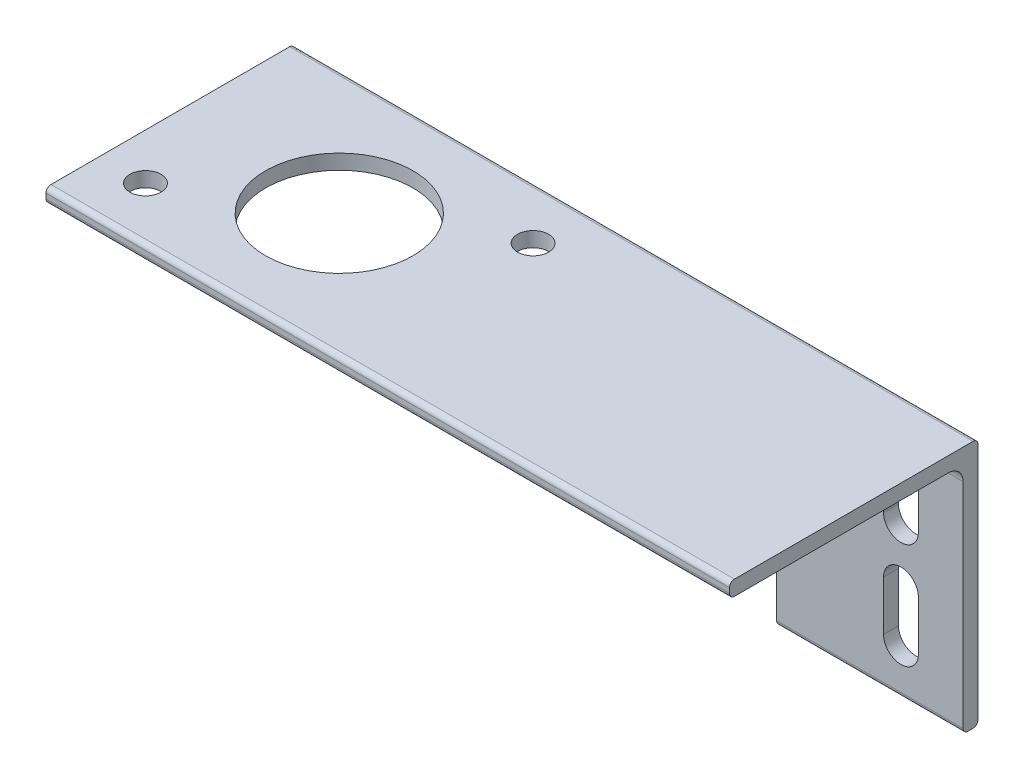
ISO-10303-21;
HEADER;
FILE_DESCRIPTION(('STEP AP214'),'2;1');
FILE_NAME('part.step','',(''),(''),'','','');
FILE_SCHEMA(('AUTOMOTIVE_DESIGN { 1 0 10303 214 1 1 1 1 }'));
ENDSEC;
DATA;
#1=APPLICATION_CONTEXT('core data for automotive mechanical design processes');
#2=APPLICATION_PROTOCOL_DEFINITION('international standard','automotive_design',2000,#1);
#3=PRODUCT_CONTEXT('',#1,'mechanical');
#4=PRODUCT('Part','Part','',(#3));
#5=PRODUCT_RELATED_PRODUCT_CATEGORY('part','',(#4));
#6=PRODUCT_DEFINITION_FORMATION('','',#4);
#7=PRODUCT_DEFINITION_CONTEXT('part definition',#1,'design');
#8=PRODUCT_DEFINITION('design','',#6,#7);
#9=PRODUCT_DEFINITION_SHAPE('','',#8);
#10=(LENGTH_UNIT() NAMED_UNIT(*) SI_UNIT(.MILLI.,.METRE.));
#11=(NAMED_UNIT(*) PLANE_ANGLE_UNIT() SI_UNIT($,.RADIAN.));
#12=(NAMED_UNIT(*) SI_UNIT($,.STERADIAN.) SOLID_ANGLE_UNIT());
#13=UNCERTAINTY_MEASURE_WITH_UNIT(LENGTH_MEASURE(1.E-05),#10,'distance_accuracy_value','');
#14=(GEOMETRIC_REPRESENTATION_CONTEXT(3) GLOBAL_UNCERTAINTY_ASSIGNED_CONTEXT((#13)) GLOBAL_UNIT_ASSIGNED_CONTEXT((#10,
#11,#12)) REPRESENTATION_CONTEXT('',''));
#15=CARTESIAN_POINT('',(0.,0.,0.));
#16=DIRECTION('',(0.,0.,1.));
#17=DIRECTION('',(1.,0.,0.));
#18=AXIS2_PLACEMENT_3D('',#15,#16,#17);
#19=CARTESIAN_POINT('',(69.85,11.176,-9.65199999999999));
#20=DIRECTION('',(0.,1.,0.));
#21=DIRECTION('',(0.,0.,1.));
#22=AXIS2_PLACEMENT_3D('',#19,#20,#21);
#23=PLANE('',#22);
#24=CARTESIAN_POINT('',(29.8293683548743,11.176,-7.25000000000002));
#25=DIRECTION('',(0.,1.,0.));
#26=DIRECTION('',(0.,0.,1.));
#27=AXIS2_PLACEMENT_3D('',#24,#25,#26);
#28=CIRCLE('',#27,1.5875);
#29=CARTESIAN_POINT('',(29.8293683548743,11.176,-5.66250000000003));
#30=VERTEX_POINT('',#29);
#31=EDGE_CURVE('E399',#30,#30,#28,.T.);
#32=ORIENTED_EDGE('',*,*,#31,.T.);
#33=EDGE_LOOP('',(#32));
#34=FACE_BOUND('',#33,.T.);
#35=CARTESIAN_POINT('',(4.71463164512565,11.176,7.25000000000002));
#36=DIRECTION('',(0.,1.,0.));
#37=DIRECTION('',(0.,0.,1.));
#38=AXIS2_PLACEMENT_3D('',#35,#36,#37);
#39=CIRCLE('',#38,1.5875);
#40=CARTESIAN_POINT('',(4.71463164512565,11.176,8.83750000000002));
#41=VERTEX_POINT('',#40);
#42=EDGE_CURVE('E395',#41,#41,#39,.T.);
#43=ORIENTED_EDGE('',*,*,#42,.T.);
#44=EDGE_LOOP('',(#43));
#45=FACE_BOUND('',#44,.T.);
#46=CARTESIAN_POINT('',(17.272,11.176,0.));
#47=DIRECTION('',(0.,1.,0.));
#48=DIRECTION('',(0.,0.,1.));
#49=AXIS2_PLACEMENT_3D('',#46,#47,#48);
#50=CIRCLE('',#49,7.53109999999999);
#51=CARTESIAN_POINT('',(17.272,11.176,7.5311));
#52=VERTEX_POINT('',#51);
#53=EDGE_CURVE('E391',#52,#52,#50,.T.);
#54=ORIENTED_EDGE('',*,*,#53,.T.);
#55=EDGE_LOOP('',(#54));
#56=FACE_BOUND('',#55,.T.);
#57=DIRECTION('',(0.,0.,-1.));
#58=VECTOR('',#57,1.);
#59=CARTESIAN_POINT('',(0.,11.176,-9.65199999999999));
#60=LINE('',#59,#58);
#61=CARTESIAN_POINT('',(0.,11.176,12.192));
#62=VERTEX_POINT('',#61);
#63=CARTESIAN_POINT('',(0.,11.176,-9.65199999999999));
#64=VERTEX_POINT('',#63);
#65=EDGE_CURVE('E403',#62,#64,#60,.T.);
#66=ORIENTED_EDGE('',*,*,#65,.T.);
#67=DIRECTION('',(-1.,0.,0.));
#68=VECTOR('',#67,1.);
#69=CARTESIAN_POINT('',(69.85,11.176,-9.65199999999999));
#70=LINE('',#69,#68);
#71=CARTESIAN_POINT('',(69.85,11.176,-9.65199999999999));
#72=VERTEX_POINT('',#71);
#73=EDGE_CURVE('E48',#72,#64,#70,.T.);
#74=ORIENTED_EDGE('',*,*,#73,.F.);
#75=DIRECTION('',(0.,0.,-1.));
#76=VECTOR('',#75,1.);
#77=CARTESIAN_POINT('',(69.85,11.176,11.176));
#78=LINE('',#77,#76);
#79=CARTESIAN_POINT('',(69.85,11.176,12.192));
#80=VERTEX_POINT('',#79);
#81=EDGE_CURVE('E404',#80,#72,#78,.T.);
#82=ORIENTED_EDGE('',*,*,#81,.F.);
#83=DIRECTION('',(-1.,0.,0.));
#84=VECTOR('',#83,1.);
#85=CARTESIAN_POINT('',(69.85,11.176,12.192));
#86=LINE('',#85,#84);
#87=EDGE_CURVE('E441',#80,#62,#86,.T.);
#88=ORIENTED_EDGE('',*,*,#87,.T.);
#89=EDGE_LOOP('',(#66,#74,#82,#88));
#90=FACE_BOUND('',#89,.T.);
#91=ADVANCED_FACE('F40',(#34,#45,#56,#90),#23,.F.);
#92=CARTESIAN_POINT('',(69.85,9.652,-9.652));
#93=DIRECTION('',(-1.,0.,0.));
#94=DIRECTION('',(0.,0.,1.));
#95=AXIS2_PLACEMENT_3D('',#92,#93,#94);
#96=CYLINDRICAL_SURFACE('',#95,1.524);
#97=DIRECTION('',(-1.,0.,0.));
#98=VECTOR('',#97,1.);
#99=CARTESIAN_POINT('',(69.85,9.65199999999999,-11.176));
#100=LINE('',#99,#98);
#101=CARTESIAN_POINT('',(63.0290713960694,9.65199999999999,-11.176));
#102=VERTEX_POINT('',#101);
#103=CARTESIAN_POINT('',(41.3856159336174,9.65199999999999,-11.176));
#104=VERTEX_POINT('',#103);
#105=EDGE_CURVE('E505',#102,#104,#100,.T.);
#106=ORIENTED_EDGE('',*,*,#105,.F.);
#107=CARTESIAN_POINT('',(63.0290713960694,9.65199999999999,-11.176));
#108=CARTESIAN_POINT('',(63.0777992399456,9.66538999720252,-11.1759819622574));
#109=CARTESIAN_POINT('',(63.1270995867601,9.67669179860836,-11.1758228229992));
#110=CARTESIAN_POINT('',(63.2264955945751,9.69506338411322,-11.1754240084948));
#111=CARTESIAN_POINT('',(63.2765914571137,9.70213207764346,-11.1751843125198));
#112=CARTESIAN_POINT('',(63.3760948841915,9.7118664264163,-11.1748302133358));
#113=CARTESIAN_POINT('',(63.425493293004,9.71462566714394,-11.1747131657762));
#114=CARTESIAN_POINT('',(63.5243279571172,9.71602027880757,-11.1746545963654));
#115=CARTESIAN_POINT('',(63.573764191208,9.7146571997042,-11.1747130085427));
#116=CARTESIAN_POINT('',(63.681436033279,9.70718513616487,-11.1750086003796));
#117=CARTESIAN_POINT('',(63.73961573386,9.70024847605331,-11.1752767170522));
#118=CARTESIAN_POINT('',(63.8557798569389,9.68055257183415,-11.1757554236398));
#119=CARTESIAN_POINT('',(63.9137513339969,9.66771693073628,-11.1759651989151));
#120=CARTESIAN_POINT('',(63.9709286039306,9.65199999999999,-11.176));
#121=B_SPLINE_CURVE_WITH_KNOTS('',3,(#107,#108,#109,#110,#111,#112,#113,#114,#115,#116,#117,
#118,#119,#120),.UNSPECIFIED.,.F.,.F.,(4,2,2,2,2,2,4),(0.,0.151554911187072,0.30314885044388,
0.451402540313249,0.599600494863249,0.775087038517862,0.952913269558954),.UNSPECIFIED.);
#122=CARTESIAN_POINT('',(63.9709286039306,9.65199999999999,-11.176));
#123=VERTEX_POINT('',#122);
#124=EDGE_CURVE('E322',#102,#123,#121,.T.);
#125=ORIENTED_EDGE('',*,*,#124,.T.);
#126=CARTESIAN_POINT('',(69.85,9.65199999999999,-11.176));
#127=VERTEX_POINT('',#126);
#128=EDGE_CURVE('E506',#127,#123,#100,.T.);
#129=ORIENTED_EDGE('',*,*,#128,.F.);
#130=CARTESIAN_POINT('',(69.85,9.652,-9.652));
#131=DIRECTION('',(-1.,0.,0.));
#132=DIRECTION('',(0.,0.,1.));
#133=AXIS2_PLACEMENT_3D('',#130,#131,#132);
#134=CIRCLE('',#133,1.524);
#135=EDGE_CURVE('E407',#72,#127,#134,.T.);
#136=ORIENTED_EDGE('',*,*,#135,.F.);
#137=ORIENTED_EDGE('',*,*,#73,.T.);
#138=CARTESIAN_POINT('',(0.,9.652,-9.652));
#139=DIRECTION('',(-1.,0.,0.));
#140=DIRECTION('',(0.,0.,1.));
#141=AXIS2_PLACEMENT_3D('',#138,#139,#140);
#142=CIRCLE('',#141,1.524);
#143=CARTESIAN_POINT('',(0.,10.0843707287529,-11.1133800166));
#144=VERTEX_POINT('',#143);
#145=EDGE_CURVE('E444',#64,#144,#142,.T.);
#146=ORIENTED_EDGE('',*,*,#145,.T.);
#147=DIRECTION('',(-1.,0.,0.));
#148=VECTOR('',#147,1.);
#149=CARTESIAN_POINT('',(69.85,10.0843707287529,-11.1133800166));
#150=LINE('',#149,#148);
#151=CARTESIAN_POINT('',(38.1,10.0843707287529,-11.1133800166));
#152=VERTEX_POINT('',#151);
#153=EDGE_CURVE('E532',#144,#152,#150,.F.);
#154=ORIENTED_EDGE('',*,*,#153,.T.);
#155=CARTESIAN_POINT('',(38.1,10.0843707287529,-11.1133800166));
#156=CARTESIAN_POINT('',(38.2388114470177,10.0843718247758,-11.113355369512));
#157=CARTESIAN_POINT('',(38.3776212297214,10.0820949547385,-11.1140526116334));
#158=CARTESIAN_POINT('',(38.6550715926149,10.072993673335,-11.1167121813116));
#159=CARTESIAN_POINT('',(38.793712182295,10.0661695300017,-11.118674434304));
#160=CARTESIAN_POINT('',(39.0700837279161,10.0480208976851,-11.1236746800685));
#161=CARTESIAN_POINT('',(39.207816040881,10.036715737824,-11.1267080464769));
#162=CARTESIAN_POINT('',(39.4828224243225,10.0096189602505,-11.1335130543283));
#163=CARTESIAN_POINT('',(39.6200964855515,9.99382725254667,-11.1372847105795));
#164=CARTESIAN_POINT('',(39.8940384819999,9.95777562730188,-11.1451233390409));
#165=CARTESIAN_POINT('',(40.0307064572966,9.937516009833,-11.1491902914063));
#166=CARTESIAN_POINT('',(40.3033124464167,9.89254799265674,-11.1570689687988));
#167=CARTESIAN_POINT('',(40.4392504781809,9.86783970280892,-11.1608807001255));
#168=CARTESIAN_POINT('',(40.7108575643859,9.81387890922683,-11.1676246646815));
#169=CARTESIAN_POINT('',(40.8465229185448,9.78460723149433,-11.1705530264769));
#170=CARTESIAN_POINT('',(41.116856991311,9.7216250449296,-11.1747306011683));
#171=CARTESIAN_POINT('',(41.2515256164727,9.6879141253387,-11.17597965856));
#172=CARTESIAN_POINT('',(41.3856159336174,9.65199999999999,-11.176));
#173=B_SPLINE_CURVE_WITH_KNOTS('',3,(#155,#156,#157,#158,#159,#160,#161,#162,#163,#164,#165,
#166,#167,#168,#169,#170,#171,#172),.UNSPECIFIED.,.F.,.F.,(4,2,2,2,2,2,2,2,4),(0.,
0.416411274834562,0.832798007051295,1.24740784368926,1.66202599716687,2.07661631268794,
2.49119639134268,2.90756784941136,3.32397786102639),.UNSPECIFIED.);
#174=EDGE_CURVE('E369',#152,#104,#173,.T.);
#175=ORIENTED_EDGE('',*,*,#174,.T.);
#176=EDGE_LOOP('',(#106,#125,#129,#136,#137,#146,#154,#175));
#177=FACE_BOUND('',#176,.T.);
#178=ADVANCED_FACE('F333',(#177),#96,.F.);
#179=CARTESIAN_POINT('',(69.85,-11.176,-11.176));
#180=DIRECTION('',(0.,0.,-1.));
#181=DIRECTION('',(-1.,0.,0.));
#182=AXIS2_PLACEMENT_3D('',#179,#180,#181);
#183=PLANE('',#182);
#184=DIRECTION('',(0.,-1.,0.));
#185=VECTOR('',#184,1.);
#186=CARTESIAN_POINT('',(65.278,-11.176,-11.176));
#187=LINE('',#186,#185);
#188=CARTESIAN_POINT('',(65.278,-2.85749999999999,-11.176));
#189=VERTEX_POINT('',#188);
#190=CARTESIAN_POINT('',(65.278,-7.93749999999999,-11.176));
#191=VERTEX_POINT('',#190);
#192=EDGE_CURVE('E579',#189,#191,#187,.T.);
#193=ORIENTED_EDGE('',*,*,#192,.T.);
#194=CARTESIAN_POINT('',(63.5,-7.93749999999999,-11.176));
#195=DIRECTION('',(0.,0.,-1.));
#196=DIRECTION('',(-1.,0.,0.));
#197=AXIS2_PLACEMENT_3D('',#194,#195,#196);
#198=CIRCLE('',#197,1.778);
#199=CARTESIAN_POINT('',(61.722,-7.93749999999999,-11.176));
#200=VERTEX_POINT('',#199);
#201=EDGE_CURVE('E576',#191,#200,#198,.T.);
#202=ORIENTED_EDGE('',*,*,#201,.T.);
#203=DIRECTION('',(0.,1.,0.));
#204=VECTOR('',#203,1.);
#205=CARTESIAN_POINT('',(61.722,-11.176,-11.176));
#206=LINE('',#205,#204);
#207=CARTESIAN_POINT('',(61.722,-2.85749999999999,-11.176));
#208=VERTEX_POINT('',#207);
#209=EDGE_CURVE('E586',#200,#208,#206,.T.);
#210=ORIENTED_EDGE('',*,*,#209,.T.);
#211=CARTESIAN_POINT('',(63.5,-2.85749999999999,-11.176));
#212=DIRECTION('',(0.,0.,-1.));
#213=DIRECTION('',(-1.,0.,0.));
#214=AXIS2_PLACEMENT_3D('',#211,#212,#213);
#215=CIRCLE('',#214,1.778);
#216=EDGE_CURVE('E253',#208,#189,#215,.T.);
#217=ORIENTED_EDGE('',*,*,#216,.T.);
#218=EDGE_LOOP('',(#193,#202,#210,#217));
#219=FACE_BOUND('',#218,.T.);
#220=ORIENTED_EDGE('',*,*,#128,.T.);
#221=CARTESIAN_POINT('',(63.5,7.9375,-11.176));
#222=DIRECTION('',(0.,0.,-1.));
#223=DIRECTION('',(-1.,0.,0.));
#224=AXIS2_PLACEMENT_3D('',#221,#222,#223);
#225=CIRCLE('',#224,1.778);
#226=CARTESIAN_POINT('',(65.278,7.9375,-11.176));
#227=VERTEX_POINT('',#226);
#228=EDGE_CURVE('E318',#123,#227,#225,.T.);
#229=ORIENTED_EDGE('',*,*,#228,.T.);
#230=DIRECTION('',(0.,-1.,0.));
#231=VECTOR('',#230,1.);
#232=CARTESIAN_POINT('',(65.278,-11.176,-11.176));
#233=LINE('',#232,#231);
#234=CARTESIAN_POINT('',(65.278,2.8575,-11.176));
#235=VERTEX_POINT('',#234);
#236=EDGE_CURVE('E331',#227,#235,#233,.T.);
#237=ORIENTED_EDGE('',*,*,#236,.T.);
#238=CARTESIAN_POINT('',(63.5,2.8575,-11.176));
#239=DIRECTION('',(0.,0.,-1.));
#240=DIRECTION('',(-1.,0.,0.));
#241=AXIS2_PLACEMENT_3D('',#238,#239,#240);
#242=CIRCLE('',#241,1.778);
#243=CARTESIAN_POINT('',(61.722,2.8575,-11.176));
#244=VERTEX_POINT('',#243);
#245=EDGE_CURVE('E588',#235,#244,#242,.T.);
#246=ORIENTED_EDGE('',*,*,#245,.T.);
#247=DIRECTION('',(0.,1.,0.));
#248=VECTOR('',#247,1.);
#249=CARTESIAN_POINT('',(61.722,-11.176,-11.176));
#250=LINE('',#249,#248);
#251=CARTESIAN_POINT('',(61.722,7.9375,-11.176));
#252=VERTEX_POINT('',#251);
#253=EDGE_CURVE('E284',#244,#252,#250,.T.);
#254=ORIENTED_EDGE('',*,*,#253,.T.);
#255=EDGE_CURVE('E323',#252,#102,#225,.T.);
#256=ORIENTED_EDGE('',*,*,#255,.T.);
#257=ORIENTED_EDGE('',*,*,#105,.T.);
#258=CARTESIAN_POINT('',(38.1,-2.61562927124714,-11.176));
#259=DIRECTION('',(0.,0.,-1.));
#260=DIRECTION('',(-1.,0.,0.));
#261=AXIS2_PLACEMENT_3D('',#258,#259,#260);
#262=CIRCLE('',#261,12.7);
#263=CARTESIAN_POINT('',(50.8,-2.61562927124714,-11.176));
#264=VERTEX_POINT('',#263);
#265=EDGE_CURVE('E378',#104,#264,#262,.T.);
#266=ORIENTED_EDGE('',*,*,#265,.T.);
#267=DIRECTION('',(0.,-1.,0.));
#268=VECTOR('',#267,1.);
#269=CARTESIAN_POINT('',(50.8,-11.176,-11.176));
#270=LINE('',#269,#268);
#271=CARTESIAN_POINT('',(50.8,-12.192,-11.176));
#272=VERTEX_POINT('',#271);
#273=EDGE_CURVE('E563',#264,#272,#270,.T.);
#274=ORIENTED_EDGE('',*,*,#273,.T.);
#275=DIRECTION('',(-1.,0.,0.));
#276=VECTOR('',#275,1.);
#277=CARTESIAN_POINT('',(69.85,-12.192,-11.176));
#278=LINE('',#277,#276);
#279=CARTESIAN_POINT('',(69.85,-12.192,-11.176));
#280=VERTEX_POINT('',#279);
#281=EDGE_CURVE('E501',#280,#272,#278,.T.);
#282=ORIENTED_EDGE('',*,*,#281,.F.);
#283=DIRECTION('',(0.,-1.,0.));
#284=VECTOR('',#283,1.);
#285=CARTESIAN_POINT('',(69.85,9.65199999999999,-11.176));
#286=LINE('',#285,#284);
#287=EDGE_CURVE('E411',#127,#280,#286,.T.);
#288=ORIENTED_EDGE('',*,*,#287,.F.);
#289=EDGE_LOOP('',(#220,#229,#237,#246,#254,#256,#257,#266,#274,#282,#288));
#290=FACE_BOUND('',#289,.T.);
#291=ADVANCED_FACE('F572',(#219,#290),#183,.F.);
#292=CARTESIAN_POINT('',(69.85,-12.192,-11.684));
#293=DIRECTION('',(-1.,0.,0.));
#294=DIRECTION('',(0.,0.,1.));
#295=AXIS2_PLACEMENT_3D('',#292,#293,#294);
#296=CYLINDRICAL_SURFACE('',#295,0.508);
#297=ORIENTED_EDGE('',*,*,#281,.T.);
#298=CARTESIAN_POINT('',(50.8,-12.192,-11.684));
#299=DIRECTION('',(1.,0.,0.));
#300=DIRECTION('',(0.,0.,-1.));
#301=AXIS2_PLACEMENT_3D('',#298,#299,#300);
#302=CIRCLE('',#301,0.508);
#303=CARTESIAN_POINT('',(50.8,-12.7,-11.684));
#304=VERTEX_POINT('',#303);
#305=EDGE_CURVE('E560',#272,#304,#302,.T.);
#306=ORIENTED_EDGE('',*,*,#305,.T.);
#307=DIRECTION('',(-1.,0.,0.));
#308=VECTOR('',#307,1.);
#309=CARTESIAN_POINT('',(69.85,-12.7,-11.684));
#310=LINE('',#309,#308);
#311=CARTESIAN_POINT('',(69.85,-12.7,-11.684));
#312=VERTEX_POINT('',#311);
#313=EDGE_CURVE('E497',#312,#304,#310,.T.);
#314=ORIENTED_EDGE('',*,*,#313,.F.);
#315=CARTESIAN_POINT('',(69.85,-12.192,-11.684));
#316=DIRECTION('',(1.,0.,0.));
#317=DIRECTION('',(0.,0.,-1.));
#318=AXIS2_PLACEMENT_3D('',#315,#316,#317);
#319=CIRCLE('',#318,0.508);
#320=EDGE_CURVE('E414',#280,#312,#319,.T.);
#321=ORIENTED_EDGE('',*,*,#320,.F.);
#322=EDGE_LOOP('',(#297,#306,#314,#321));
#323=FACE_BOUND('',#322,.T.);
#324=ADVANCED_FACE('F632',(#323),#296,.T.);
#325=CARTESIAN_POINT('',(69.85,-12.7,-12.192));
#326=DIRECTION('',(0.,1.,0.));
#327=DIRECTION('',(0.,0.,1.));
#328=AXIS2_PLACEMENT_3D('',#325,#326,#327);
#329=PLANE('',#328);
#330=ORIENTED_EDGE('',*,*,#313,.T.);
#331=DIRECTION('',(0.,0.,-1.));
#332=VECTOR('',#331,1.);
#333=CARTESIAN_POINT('',(50.8,-12.7,-12.192));
#334=LINE('',#333,#332);
#335=CARTESIAN_POINT('',(50.8,-12.7,-12.192));
#336=VERTEX_POINT('',#335);
#337=EDGE_CURVE('E556',#304,#336,#334,.T.);
#338=ORIENTED_EDGE('',*,*,#337,.T.);
#339=DIRECTION('',(-1.,0.,0.));
#340=VECTOR('',#339,1.);
#341=CARTESIAN_POINT('',(69.85,-12.7,-12.192));
#342=LINE('',#341,#340);
#343=CARTESIAN_POINT('',(69.85,-12.7,-12.192));
#344=VERTEX_POINT('',#343);
#345=EDGE_CURVE('E493',#344,#336,#342,.T.);
#346=ORIENTED_EDGE('',*,*,#345,.F.);
#347=DIRECTION('',(0.,0.,-1.));
#348=VECTOR('',#347,1.);
#349=CARTESIAN_POINT('',(69.85,-12.7,-12.192));
#350=LINE('',#349,#348);
#351=EDGE_CURVE('E417',#312,#344,#350,.T.);
#352=ORIENTED_EDGE('',*,*,#351,.F.);
#353=EDGE_LOOP('',(#330,#338,#346,#352));
#354=FACE_BOUND('',#353,.T.);
#355=ADVANCED_FACE('F630',(#354),#329,.F.);
#356=CARTESIAN_POINT('',(69.85,-12.192,-12.192));
#357=DIRECTION('',(-1.,0.,0.));
#358=DIRECTION('',(0.,0.,1.));
#359=AXIS2_PLACEMENT_3D('',#356,#357,#358);
#360=CYLINDRICAL_SURFACE('',#359,0.508);
#361=ORIENTED_EDGE('',*,*,#345,.T.);
#362=CARTESIAN_POINT('',(50.8,-12.192,-12.192));
#363=DIRECTION('',(1.,0.,0.));
#364=DIRECTION('',(0.,0.,-1.));
#365=AXIS2_PLACEMENT_3D('',#362,#363,#364);
#366=CIRCLE('',#365,0.508);
#367=CARTESIAN_POINT('',(50.8,-12.192,-12.7));
#368=VERTEX_POINT('',#367);
#369=EDGE_CURVE('E552',#336,#368,#366,.T.);
#370=ORIENTED_EDGE('',*,*,#369,.T.);
#371=DIRECTION('',(-1.,0.,0.));
#372=VECTOR('',#371,1.);
#373=CARTESIAN_POINT('',(69.85,-12.192,-12.7));
#374=LINE('',#373,#372);
#375=CARTESIAN_POINT('',(69.85,-12.192,-12.7));
#376=VERTEX_POINT('',#375);
#377=EDGE_CURVE('E489',#376,#368,#374,.T.);
#378=ORIENTED_EDGE('',*,*,#377,.F.);
#379=CARTESIAN_POINT('',(69.85,-12.192,-12.192));
#380=DIRECTION('',(1.,0.,0.));
#381=DIRECTION('',(0.,0.,1.));
#382=AXIS2_PLACEMENT_3D('',#379,#380,#381);
#383=CIRCLE('',#382,0.508);
#384=EDGE_CURVE('E420',#344,#376,#383,.T.);
#385=ORIENTED_EDGE('',*,*,#384,.F.);
#386=EDGE_LOOP('',(#361,#370,#378,#385));
#387=FACE_BOUND('',#386,.T.);
#388=ADVANCED_FACE('F628',(#387),#360,.T.);
#389=CARTESIAN_POINT('',(69.85,12.192,-12.7));
#390=DIRECTION('',(0.,0.,1.));
#391=DIRECTION('',(0.,-1.,0.));
#392=AXIS2_PLACEMENT_3D('',#389,#390,#391);
#393=PLANE('',#392);
#394=DIRECTION('',(0.,1.,0.));
#395=VECTOR('',#394,1.);
#396=CARTESIAN_POINT('',(61.722,-7.93749999999999,-12.7));
#397=LINE('',#396,#395);
#398=CARTESIAN_POINT('',(61.722,-7.93749999999999,-12.7));
#399=VERTEX_POINT('',#398);
#400=CARTESIAN_POINT('',(61.722,-2.85749999999999,-12.7));
#401=VERTEX_POINT('',#400);
#402=EDGE_CURVE('E261',#399,#401,#397,.T.);
#403=ORIENTED_EDGE('',*,*,#402,.F.);
#404=CARTESIAN_POINT('',(63.5,-7.93749999999999,-12.7));
#405=DIRECTION('',(0.,0.,-1.));
#406=DIRECTION('',(0.,1.,0.));
#407=AXIS2_PLACEMENT_3D('',#404,#405,#406);
#408=CIRCLE('',#407,1.778);
#409=CARTESIAN_POINT('',(65.278,-7.93749999999999,-12.7));
#410=VERTEX_POINT('',#409);
#411=EDGE_CURVE('E267',#410,#399,#408,.T.);
#412=ORIENTED_EDGE('',*,*,#411,.F.);
#413=DIRECTION('',(0.,-1.,0.));
#414=VECTOR('',#413,1.);
#415=CARTESIAN_POINT('',(65.278,-7.93749999999999,-12.7));
#416=LINE('',#415,#414);
#417=CARTESIAN_POINT('',(65.278,-2.85749999999999,-12.7));
#418=VERTEX_POINT('',#417);
#419=EDGE_CURVE('E272',#418,#410,#416,.T.);
#420=ORIENTED_EDGE('',*,*,#419,.F.);
#421=CARTESIAN_POINT('',(63.5,-2.85749999999999,-12.7));
#422=DIRECTION('',(0.,0.,-1.));
#423=DIRECTION('',(0.,1.,0.));
#424=AXIS2_PLACEMENT_3D('',#421,#422,#423);
#425=CIRCLE('',#424,1.778);
#426=EDGE_CURVE('E250',#401,#418,#425,.T.);
#427=ORIENTED_EDGE('',*,*,#426,.F.);
#428=EDGE_LOOP('',(#403,#412,#420,#427));
#429=FACE_BOUND('',#428,.T.);
#430=DIRECTION('',(0.,1.,0.));
#431=VECTOR('',#430,1.);
#432=CARTESIAN_POINT('',(61.722,2.8575,-12.7));
#433=LINE('',#432,#431);
#434=CARTESIAN_POINT('',(61.722,2.8575,-12.7));
#435=VERTEX_POINT('',#434);
#436=CARTESIAN_POINT('',(61.722,7.9375,-12.7));
#437=VERTEX_POINT('',#436);
#438=EDGE_CURVE('E292',#435,#437,#433,.T.);
#439=ORIENTED_EDGE('',*,*,#438,.F.);
#440=CARTESIAN_POINT('',(63.5,2.8575,-12.7));
#441=DIRECTION('',(0.,0.,-1.));
#442=DIRECTION('',(0.,1.,0.));
#443=AXIS2_PLACEMENT_3D('',#440,#441,#442);
#444=CIRCLE('',#443,1.778);
#445=CARTESIAN_POINT('',(65.278,2.8575,-12.7));
#446=VERTEX_POINT('',#445);
#447=EDGE_CURVE('E289',#446,#435,#444,.T.);
#448=ORIENTED_EDGE('',*,*,#447,.F.);
#449=DIRECTION('',(0.,-1.,0.));
#450=VECTOR('',#449,1.);
#451=CARTESIAN_POINT('',(65.278,2.8575,-12.7));
#452=LINE('',#451,#450);
#453=CARTESIAN_POINT('',(65.278,7.9375,-12.7));
#454=VERTEX_POINT('',#453);
#455=EDGE_CURVE('E299',#454,#446,#452,.T.);
#456=ORIENTED_EDGE('',*,*,#455,.F.);
#457=CARTESIAN_POINT('',(63.5,7.9375,-12.7));
#458=DIRECTION('',(0.,0.,-1.));
#459=DIRECTION('',(0.,1.,0.));
#460=AXIS2_PLACEMENT_3D('',#457,#458,#459);
#461=CIRCLE('',#460,1.778);
#462=EDGE_CURVE('E295',#437,#454,#461,.T.);
#463=ORIENTED_EDGE('',*,*,#462,.F.);
#464=EDGE_LOOP('',(#439,#448,#456,#463));
#465=FACE_BOUND('',#464,.T.);
#466=CARTESIAN_POINT('',(38.1,-2.61562927124714,-12.7));
#467=DIRECTION('',(0.,0.,-1.));
#468=DIRECTION('',(0.,1.,0.));
#469=AXIS2_PLACEMENT_3D('',#466,#467,#468);
#470=CIRCLE('',#469,12.7);
#471=CARTESIAN_POINT('',(38.1,10.0843707287529,-12.7));
#472=VERTEX_POINT('',#471);
#473=CARTESIAN_POINT('',(50.8,-2.61562927124714,-12.7));
#474=VERTEX_POINT('',#473);
#475=EDGE_CURVE('E537',#472,#474,#470,.T.);
#476=ORIENTED_EDGE('',*,*,#475,.F.);
#477=DIRECTION('',(1.,0.,0.));
#478=VECTOR('',#477,1.);
#479=CARTESIAN_POINT('',(38.1,10.0843707287529,-12.7));
#480=LINE('',#479,#478);
#481=CARTESIAN_POINT('',(0.,10.0843707287529,-12.7));
#482=VERTEX_POINT('',#481);
#483=EDGE_CURVE('E530',#482,#472,#480,.T.);
#484=ORIENTED_EDGE('',*,*,#483,.F.);
#485=DIRECTION('',(0.,1.,0.));
#486=VECTOR('',#485,1.);
#487=CARTESIAN_POINT('',(0.,12.192,-12.7));
#488=LINE('',#487,#486);
#489=CARTESIAN_POINT('',(0.,12.192,-12.7));
#490=VERTEX_POINT('',#489);
#491=EDGE_CURVE('E448',#482,#490,#488,.T.);
#492=ORIENTED_EDGE('',*,*,#491,.T.);
#493=DIRECTION('',(-1.,0.,0.));
#494=VECTOR('',#493,1.);
#495=CARTESIAN_POINT('',(69.85,12.192,-12.7));
#496=LINE('',#495,#494);
#497=CARTESIAN_POINT('',(69.85,12.192,-12.7));
#498=VERTEX_POINT('',#497);
#499=EDGE_CURVE('E485',#498,#490,#496,.T.);
#500=ORIENTED_EDGE('',*,*,#499,.F.);
#501=DIRECTION('',(0.,1.,0.));
#502=VECTOR('',#501,1.);
#503=CARTESIAN_POINT('',(69.85,12.192,-12.7));
#504=LINE('',#503,#502);
#505=EDGE_CURVE('E423',#376,#498,#504,.T.);
#506=ORIENTED_EDGE('',*,*,#505,.F.);
#507=ORIENTED_EDGE('',*,*,#377,.T.);
#508=DIRECTION('',(0.,-1.,0.));
#509=VECTOR('',#508,1.);
#510=CARTESIAN_POINT('',(50.8,-2.61562927124714,-12.7));
#511=LINE('',#510,#509);
#512=EDGE_CURVE('E540',#474,#368,#511,.T.);
#513=ORIENTED_EDGE('',*,*,#512,.F.);
#514=EDGE_LOOP('',(#476,#484,#492,#500,#506,#507,#513));
#515=FACE_BOUND('',#514,.T.);
#516=ADVANCED_FACE('F269',(#429,#465,#515),#393,.F.);
#517=CARTESIAN_POINT('',(69.85,12.192,-12.192));
#518=DIRECTION('',(-1.,0.,0.));
#519=DIRECTION('',(0.,0.,1.));
#520=AXIS2_PLACEMENT_3D('',#517,#518,#519);
#521=CYLINDRICAL_SURFACE('',#520,0.508);
#522=CARTESIAN_POINT('',(0.,12.192,-12.192));
#523=DIRECTION('',(1.,0.,0.));
#524=DIRECTION('',(0.,0.,1.));
#525=AXIS2_PLACEMENT_3D('',#522,#523,#524);
#526=CIRCLE('',#525,0.508);
#527=CARTESIAN_POINT('',(0.,12.7,-12.192));
#528=VERTEX_POINT('',#527);
#529=EDGE_CURVE('E451',#490,#528,#526,.T.);
#530=ORIENTED_EDGE('',*,*,#529,.T.);
#531=DIRECTION('',(-1.,0.,0.));
#532=VECTOR('',#531,1.);
#533=CARTESIAN_POINT('',(69.85,12.7,-12.192));
#534=LINE('',#533,#532);
#535=CARTESIAN_POINT('',(69.85,12.7,-12.192));
#536=VERTEX_POINT('',#535);
#537=EDGE_CURVE('E481',#536,#528,#534,.T.);
#538=ORIENTED_EDGE('',*,*,#537,.F.);
#539=CARTESIAN_POINT('',(69.85,12.192,-12.192));
#540=DIRECTION('',(1.,0.,0.));
#541=DIRECTION('',(0.,0.,1.));
#542=AXIS2_PLACEMENT_3D('',#539,#540,#541);
#543=CIRCLE('',#542,0.508);
#544=EDGE_CURVE('E426',#498,#536,#543,.T.);
#545=ORIENTED_EDGE('',*,*,#544,.F.);
#546=ORIENTED_EDGE('',*,*,#499,.T.);
#547=EDGE_LOOP('',(#530,#538,#545,#546));
#548=FACE_BOUND('',#547,.T.);
#549=ADVANCED_FACE('F620',(#548),#521,.T.);
#550=CARTESIAN_POINT('',(69.85,12.7,-12.192));
#551=DIRECTION('',(0.,-1.,0.));
#552=DIRECTION('',(0.,0.,-1.));
#553=AXIS2_PLACEMENT_3D('',#550,#551,#552);
#554=PLANE('',#553);
#555=CARTESIAN_POINT('',(29.8293683548743,12.7,-7.25000000000002));
#556=DIRECTION('',(0.,1.,0.));
#557=DIRECTION('',(0.,0.,1.));
#558=AXIS2_PLACEMENT_3D('',#555,#556,#557);
#559=CIRCLE('',#558,1.5875);
#560=CARTESIAN_POINT('',(29.8293683548743,12.7,-5.66250000000003));
#561=VERTEX_POINT('',#560);
#562=EDGE_CURVE('E377',#561,#561,#559,.T.);
#563=ORIENTED_EDGE('',*,*,#562,.F.);
#564=EDGE_LOOP('',(#563));
#565=FACE_BOUND('',#564,.T.);
#566=CARTESIAN_POINT('',(4.71463164512565,12.7,7.25000000000002));
#567=DIRECTION('',(0.,1.,0.));
#568=DIRECTION('',(0.,0.,1.));
#569=AXIS2_PLACEMENT_3D('',#566,#567,#568);
#570=CIRCLE('',#569,1.5875);
#571=CARTESIAN_POINT('',(4.71463164512565,12.7,8.83750000000002));
#572=VERTEX_POINT('',#571);
#573=EDGE_CURVE('E380',#572,#572,#570,.T.);
#574=ORIENTED_EDGE('',*,*,#573,.F.);
#575=EDGE_LOOP('',(#574));
#576=FACE_BOUND('',#575,.T.);
#577=CARTESIAN_POINT('',(17.272,12.7,0.));
#578=DIRECTION('',(0.,1.,0.));
#579=DIRECTION('',(0.,0.,1.));
#580=AXIS2_PLACEMENT_3D('',#577,#578,#579);
#581=CIRCLE('',#580,7.53109999999999);
#582=CARTESIAN_POINT('',(17.272,12.7,7.5311));
#583=VERTEX_POINT('',#582);
#584=EDGE_CURVE('E384',#583,#583,#581,.T.);
#585=ORIENTED_EDGE('',*,*,#584,.F.);
#586=EDGE_LOOP('',(#585));
#587=FACE_BOUND('',#586,.T.);
#588=DIRECTION('',(0.,0.,1.));
#589=VECTOR('',#588,1.);
#590=CARTESIAN_POINT('',(0.,12.7,-12.192));
#591=LINE('',#590,#589);
#592=CARTESIAN_POINT('',(0.,12.7,12.192));
#593=VERTEX_POINT('',#592);
#594=EDGE_CURVE('E454',#528,#593,#591,.T.);
#595=ORIENTED_EDGE('',*,*,#594,.T.);
#596=DIRECTION('',(-1.,0.,0.));
#597=VECTOR('',#596,1.);
#598=CARTESIAN_POINT('',(69.85,12.7,12.192));
#599=LINE('',#598,#597);
#600=CARTESIAN_POINT('',(69.85,12.7,12.192));
#601=VERTEX_POINT('',#600);
#602=EDGE_CURVE('E477',#601,#593,#599,.T.);
#603=ORIENTED_EDGE('',*,*,#602,.F.);
#604=DIRECTION('',(0.,0.,1.));
#605=VECTOR('',#604,1.);
#606=CARTESIAN_POINT('',(69.85,12.7,-12.192));
#607=LINE('',#606,#605);
#608=EDGE_CURVE('E429',#536,#601,#607,.T.);
#609=ORIENTED_EDGE('',*,*,#608,.F.);
#610=ORIENTED_EDGE('',*,*,#537,.T.);
#611=EDGE_LOOP('',(#595,#603,#609,#610));
#612=FACE_BOUND('',#611,.T.);
#613=ADVANCED_FACE('F617',(#565,#576,#587,#612),#554,.F.);
#614=CARTESIAN_POINT('',(69.85,12.192,12.192));
#615=DIRECTION('',(-1.,0.,0.));
#616=DIRECTION('',(0.,0.,1.));
#617=AXIS2_PLACEMENT_3D('',#614,#615,#616);
#618=CYLINDRICAL_SURFACE('',#617,0.508);
#619=CARTESIAN_POINT('',(0.,12.192,12.192));
#620=DIRECTION('',(1.,0.,0.));
#621=DIRECTION('',(0.,0.,-1.));
#622=AXIS2_PLACEMENT_3D('',#619,#620,#621);
#623=CIRCLE('',#622,0.508);
#624=CARTESIAN_POINT('',(0.,12.192,12.7));
#625=VERTEX_POINT('',#624);
#626=EDGE_CURVE('E457',#593,#625,#623,.T.);
#627=ORIENTED_EDGE('',*,*,#626,.T.);
#628=DIRECTION('',(-1.,0.,0.));
#629=VECTOR('',#628,1.);
#630=CARTESIAN_POINT('',(69.85,12.192,12.7));
#631=LINE('',#630,#629);
#632=CARTESIAN_POINT('',(69.85,12.192,12.7));
#633=VERTEX_POINT('',#632);
#634=EDGE_CURVE('E473',#633,#625,#631,.T.);
#635=ORIENTED_EDGE('',*,*,#634,.F.);
#636=CARTESIAN_POINT('',(69.85,12.192,12.192));
#637=DIRECTION('',(1.,0.,0.));
#638=DIRECTION('',(0.,0.,-1.));
#639=AXIS2_PLACEMENT_3D('',#636,#637,#638);
#640=CIRCLE('',#639,0.508);
#641=EDGE_CURVE('E432',#601,#633,#640,.T.);
#642=ORIENTED_EDGE('',*,*,#641,.F.);
#643=ORIENTED_EDGE('',*,*,#602,.T.);
#644=EDGE_LOOP('',(#627,#635,#642,#643));
#645=FACE_BOUND('',#644,.T.);
#646=ADVANCED_FACE('F613',(#645),#618,.T.);
#647=CARTESIAN_POINT('',(69.85,12.192,12.7));
#648=DIRECTION('',(0.,0.,-1.));
#649=DIRECTION('',(-1.,0.,0.));
#650=AXIS2_PLACEMENT_3D('',#647,#648,#649);
#651=PLANE('',#650);
#652=DIRECTION('',(0.,-1.,0.));
#653=VECTOR('',#652,1.);
#654=CARTESIAN_POINT('',(0.,12.192,12.7));
#655=LINE('',#654,#653);
#656=CARTESIAN_POINT('',(0.,11.684,12.7));
#657=VERTEX_POINT('',#656);
#658=EDGE_CURVE('E460',#625,#657,#655,.T.);
#659=ORIENTED_EDGE('',*,*,#658,.T.);
#660=DIRECTION('',(-1.,0.,0.));
#661=VECTOR('',#660,1.);
#662=CARTESIAN_POINT('',(69.85,11.684,12.7));
#663=LINE('',#662,#661);
#664=CARTESIAN_POINT('',(69.85,11.684,12.7));
#665=VERTEX_POINT('',#664);
#666=EDGE_CURVE('E469',#665,#657,#663,.T.);
#667=ORIENTED_EDGE('',*,*,#666,.F.);
#668=DIRECTION('',(0.,-1.,0.));
#669=VECTOR('',#668,1.);
#670=CARTESIAN_POINT('',(69.85,12.192,12.7));
#671=LINE('',#670,#669);
#672=EDGE_CURVE('E435',#633,#665,#671,.T.);
#673=ORIENTED_EDGE('',*,*,#672,.F.);
#674=ORIENTED_EDGE('',*,*,#634,.T.);
#675=EDGE_LOOP('',(#659,#667,#673,#674));
#676=FACE_BOUND('',#675,.T.);
#677=ADVANCED_FACE('F608',(#676),#651,.F.);
#678=CARTESIAN_POINT('',(69.85,11.684,12.192));
#679=DIRECTION('',(-1.,0.,0.));
#680=DIRECTION('',(0.,0.,1.));
#681=AXIS2_PLACEMENT_3D('',#678,#679,#680);
#682=CYLINDRICAL_SURFACE('',#681,0.508);
#683=CARTESIAN_POINT('',(0.,11.684,12.192));
#684=DIRECTION('',(1.,0.,0.));
#685=DIRECTION('',(0.,0.,1.));
#686=AXIS2_PLACEMENT_3D('',#683,#684,#685);
#687=CIRCLE('',#686,0.508);
#688=EDGE_CURVE('E408',#657,#62,#687,.T.);
#689=ORIENTED_EDGE('',*,*,#688,.T.);
#690=ORIENTED_EDGE('',*,*,#87,.F.);
#691=CARTESIAN_POINT('',(69.85,11.684,12.192));
#692=DIRECTION('',(1.,0.,0.));
#693=DIRECTION('',(0.,0.,1.));
#694=AXIS2_PLACEMENT_3D('',#691,#692,#693);
#695=CIRCLE('',#694,0.508);
#696=EDGE_CURVE('E438',#665,#80,#695,.T.);
#697=ORIENTED_EDGE('',*,*,#696,.F.);
#698=ORIENTED_EDGE('',*,*,#666,.T.);
#699=EDGE_LOOP('',(#689,#690,#697,#698));
#700=FACE_BOUND('',#699,.T.);
#701=ADVANCED_FACE('F602',(#700),#682,.T.);
#702=CARTESIAN_POINT('',(69.85,11.684,12.192));
#703=DIRECTION('',(-1.,0.,0.));
#704=DIRECTION('',(0.,0.,1.));
#705=AXIS2_PLACEMENT_3D('',#702,#703,#704);
#706=PLANE('',#705);
#707=ORIENTED_EDGE('',*,*,#81,.T.);
#708=ORIENTED_EDGE('',*,*,#135,.T.);
#709=ORIENTED_EDGE('',*,*,#287,.T.);
#710=ORIENTED_EDGE('',*,*,#320,.T.);
#711=ORIENTED_EDGE('',*,*,#351,.T.);
#712=ORIENTED_EDGE('',*,*,#384,.T.);
#713=ORIENTED_EDGE('',*,*,#505,.T.);
#714=ORIENTED_EDGE('',*,*,#544,.T.);
#715=ORIENTED_EDGE('',*,*,#608,.T.);
#716=ORIENTED_EDGE('',*,*,#641,.T.);
#717=ORIENTED_EDGE('',*,*,#672,.T.);
#718=ORIENTED_EDGE('',*,*,#696,.T.);
#719=EDGE_LOOP('',(#707,#708,#709,#710,#711,#712,#713,#714,#715,#716,#717,#718));
#720=FACE_BOUND('',#719,.T.);
#721=ADVANCED_FACE('F597',(#720),#706,.F.);
#722=CARTESIAN_POINT('',(0.,11.684,12.192));
#723=DIRECTION('',(-1.,0.,0.));
#724=DIRECTION('',(0.,0.,1.));
#725=AXIS2_PLACEMENT_3D('',#722,#723,#724);
#726=PLANE('',#725);
#727=DIRECTION('',(0.,0.,-1.));
#728=VECTOR('',#727,1.);
#729=CARTESIAN_POINT('',(0.,10.0843707287529,12.7));
#730=LINE('',#729,#728);
#731=EDGE_CURVE('E11',#144,#482,#730,.T.);
#732=ORIENTED_EDGE('',*,*,#731,.F.);
#733=ORIENTED_EDGE('',*,*,#145,.F.);
#734=ORIENTED_EDGE('',*,*,#65,.F.);
#735=ORIENTED_EDGE('',*,*,#688,.F.);
#736=ORIENTED_EDGE('',*,*,#658,.F.);
#737=ORIENTED_EDGE('',*,*,#626,.F.);
#738=ORIENTED_EDGE('',*,*,#594,.F.);
#739=ORIENTED_EDGE('',*,*,#529,.F.);
#740=ORIENTED_EDGE('',*,*,#491,.F.);
#741=EDGE_LOOP('',(#732,#733,#734,#735,#736,#737,#738,#739,#740));
#742=FACE_BOUND('',#741,.T.);
#743=ADVANCED_FACE('F523',(#742),#726,.T.);
#744=CARTESIAN_POINT('',(17.272,-12.7,0.));
#745=DIRECTION('',(0.,1.,0.));
#746=DIRECTION('',(0.,0.,1.));
#747=AXIS2_PLACEMENT_3D('',#744,#745,#746);
#748=CYLINDRICAL_SURFACE('',#747,7.53109999999999);
#749=ORIENTED_EDGE('',*,*,#584,.T.);
#750=EDGE_LOOP('',(#749));
#751=FACE_BOUND('',#750,.T.);
#752=ORIENTED_EDGE('',*,*,#53,.F.);
#753=EDGE_LOOP('',(#752));
#754=FACE_BOUND('',#753,.T.);
#755=ADVANCED_FACE('F652',(#751,#754),#748,.F.);
#756=CARTESIAN_POINT('',(4.71463164512565,-12.7,7.25000000000002));
#757=DIRECTION('',(0.,1.,0.));
#758=DIRECTION('',(0.,0.,1.));
#759=AXIS2_PLACEMENT_3D('',#756,#757,#758);
#760=CYLINDRICAL_SURFACE('',#759,1.5875);
#761=ORIENTED_EDGE('',*,*,#573,.T.);
#762=EDGE_LOOP('',(#761));
#763=FACE_BOUND('',#762,.T.);
#764=ORIENTED_EDGE('',*,*,#42,.F.);
#765=EDGE_LOOP('',(#764));
#766=FACE_BOUND('',#765,.T.);
#767=ADVANCED_FACE('F366',(#763,#766),#760,.F.);
#768=CARTESIAN_POINT('',(29.8293683548743,-12.7,-7.25000000000003));
#769=DIRECTION('',(0.,1.,0.));
#770=DIRECTION('',(0.,0.,1.));
#771=AXIS2_PLACEMENT_3D('',#768,#769,#770);
#772=CYLINDRICAL_SURFACE('',#771,1.5875);
#773=ORIENTED_EDGE('',*,*,#562,.T.);
#774=EDGE_LOOP('',(#773));
#775=FACE_BOUND('',#774,.T.);
#776=ORIENTED_EDGE('',*,*,#31,.F.);
#777=EDGE_LOOP('',(#776));
#778=FACE_BOUND('',#777,.T.);
#779=ADVANCED_FACE('F364',(#775,#778),#772,.F.);
#780=CARTESIAN_POINT('',(38.1,-2.61562927124715,12.7));
#781=DIRECTION('',(0.,0.,-1.));
#782=DIRECTION('',(0.,1.,0.));
#783=AXIS2_PLACEMENT_3D('',#780,#781,#782);
#784=CYLINDRICAL_SURFACE('',#783,12.7);
#785=DIRECTION('',(0.,0.,-1.));
#786=VECTOR('',#785,1.);
#787=CARTESIAN_POINT('',(38.1,10.0843707287529,12.7));
#788=LINE('',#787,#786);
#789=EDGE_CURVE('E543',#152,#472,#788,.T.);
#790=ORIENTED_EDGE('',*,*,#789,.T.);
#791=ORIENTED_EDGE('',*,*,#475,.T.);
#792=DIRECTION('',(0.,0.,-1.));
#793=VECTOR('',#792,1.);
#794=CARTESIAN_POINT('',(50.8,-2.61562927124714,12.7));
#795=LINE('',#794,#793);
#796=EDGE_CURVE('E539',#264,#474,#795,.T.);
#797=ORIENTED_EDGE('',*,*,#796,.F.);
#798=ORIENTED_EDGE('',*,*,#265,.F.);
#799=ORIENTED_EDGE('',*,*,#174,.F.);
#800=EDGE_LOOP('',(#790,#791,#797,#798,#799));
#801=FACE_BOUND('',#800,.T.);
#802=ADVANCED_FACE('F359',(#801),#784,.F.);
#803=CARTESIAN_POINT('',(50.8,-2.61562927124714,12.7));
#804=DIRECTION('',(1.,0.,0.));
#805=DIRECTION('',(0.,0.,-1.));
#806=AXIS2_PLACEMENT_3D('',#803,#804,#805);
#807=PLANE('',#806);
#808=ORIENTED_EDGE('',*,*,#796,.T.);
#809=ORIENTED_EDGE('',*,*,#512,.T.);
#810=ORIENTED_EDGE('',*,*,#369,.F.);
#811=ORIENTED_EDGE('',*,*,#337,.F.);
#812=ORIENTED_EDGE('',*,*,#305,.F.);
#813=ORIENTED_EDGE('',*,*,#273,.F.);
#814=EDGE_LOOP('',(#808,#809,#810,#811,#812,#813));
#815=FACE_BOUND('',#814,.T.);
#816=ADVANCED_FACE('F355',(#815),#807,.F.);
#817=CARTESIAN_POINT('',(38.1,10.0843707287529,12.7));
#818=DIRECTION('',(0.,1.,0.));
#819=DIRECTION('',(0.,0.,1.));
#820=AXIS2_PLACEMENT_3D('',#817,#818,#819);
#821=PLANE('',#820);
#822=ORIENTED_EDGE('',*,*,#731,.T.);
#823=ORIENTED_EDGE('',*,*,#483,.T.);
#824=ORIENTED_EDGE('',*,*,#789,.F.);
#825=ORIENTED_EDGE('',*,*,#153,.F.);
#826=EDGE_LOOP('',(#822,#823,#824,#825));
#827=FACE_BOUND('',#826,.T.);
#828=ADVANCED_FACE('F351',(#827),#821,.F.);
#829=CARTESIAN_POINT('',(63.5,2.8575,12.7));
#830=DIRECTION('',(0.,0.,-1.));
#831=DIRECTION('',(0.,1.,0.));
#832=AXIS2_PLACEMENT_3D('',#829,#830,#831);
#833=CYLINDRICAL_SURFACE('',#832,1.778);
#834=DIRECTION('',(0.,0.,-1.));
#835=VECTOR('',#834,1.);
#836=CARTESIAN_POINT('',(65.278,2.8575,12.7));
#837=LINE('',#836,#835);
#838=EDGE_CURVE('E304',#235,#446,#837,.T.);
#839=ORIENTED_EDGE('',*,*,#838,.T.);
#840=ORIENTED_EDGE('',*,*,#447,.T.);
#841=DIRECTION('',(0.,0.,-1.));
#842=VECTOR('',#841,1.);
#843=CARTESIAN_POINT('',(61.722,2.8575,12.7));
#844=LINE('',#843,#842);
#845=EDGE_CURVE('E303',#244,#435,#844,.T.);
#846=ORIENTED_EDGE('',*,*,#845,.F.);
#847=ORIENTED_EDGE('',*,*,#245,.F.);
#848=EDGE_LOOP('',(#839,#840,#846,#847));
#849=FACE_BOUND('',#848,.T.);
#850=ADVANCED_FACE('F348',(#849),#833,.F.);
#851=CARTESIAN_POINT('',(65.278,2.8575,12.7));
#852=DIRECTION('',(1.,0.,0.));
#853=DIRECTION('',(0.,0.,-1.));
#854=AXIS2_PLACEMENT_3D('',#851,#852,#853);
#855=PLANE('',#854);
#856=DIRECTION('',(0.,0.,-1.));
#857=VECTOR('',#856,1.);
#858=CARTESIAN_POINT('',(65.278,7.9375,12.7));
#859=LINE('',#858,#857);
#860=EDGE_CURVE('E307',#227,#454,#859,.T.);
#861=ORIENTED_EDGE('',*,*,#860,.T.);
#862=ORIENTED_EDGE('',*,*,#455,.T.);
#863=ORIENTED_EDGE('',*,*,#838,.F.);
#864=ORIENTED_EDGE('',*,*,#236,.F.);
#865=EDGE_LOOP('',(#861,#862,#863,#864));
#866=FACE_BOUND('',#865,.T.);
#867=ADVANCED_FACE('F342',(#866),#855,.F.);
#868=CARTESIAN_POINT('',(63.5,7.9375,12.7));
#869=DIRECTION('',(0.,0.,-1.));
#870=DIRECTION('',(0.,1.,0.));
#871=AXIS2_PLACEMENT_3D('',#868,#869,#870);
#872=CYLINDRICAL_SURFACE('',#871,1.778);
#873=DIRECTION('',(0.,0.,-1.));
#874=VECTOR('',#873,1.);
#875=CARTESIAN_POINT('',(61.722,7.9375,12.7));
#876=LINE('',#875,#874);
#877=EDGE_CURVE('E69',#252,#437,#876,.T.);
#878=ORIENTED_EDGE('',*,*,#877,.T.);
#879=ORIENTED_EDGE('',*,*,#462,.T.);
#880=ORIENTED_EDGE('',*,*,#860,.F.);
#881=ORIENTED_EDGE('',*,*,#228,.F.);
#882=ORIENTED_EDGE('',*,*,#124,.F.);
#883=ORIENTED_EDGE('',*,*,#255,.F.);
#884=EDGE_LOOP('',(#878,#879,#880,#881,#882,#883));
#885=FACE_BOUND('',#884,.T.);
#886=ADVANCED_FACE('F336',(#885),#872,.F.);
#887=CARTESIAN_POINT('',(61.722,2.8575,12.7));
#888=DIRECTION('',(-1.,0.,0.));
#889=DIRECTION('',(0.,0.,1.));
#890=AXIS2_PLACEMENT_3D('',#887,#888,#889);
#891=PLANE('',#890);
#892=ORIENTED_EDGE('',*,*,#845,.T.);
#893=ORIENTED_EDGE('',*,*,#438,.T.);
#894=ORIENTED_EDGE('',*,*,#877,.F.);
#895=ORIENTED_EDGE('',*,*,#253,.F.);
#896=EDGE_LOOP('',(#892,#893,#894,#895));
#897=FACE_BOUND('',#896,.T.);
#898=ADVANCED_FACE('F341',(#897),#891,.F.);
#899=CARTESIAN_POINT('',(63.5,-7.93749999999999,12.7));
#900=DIRECTION('',(0.,0.,-1.));
#901=DIRECTION('',(0.,1.,0.));
#902=AXIS2_PLACEMENT_3D('',#899,#900,#901);
#903=CYLINDRICAL_SURFACE('',#902,1.778);
#904=DIRECTION('',(0.,0.,-1.));
#905=VECTOR('',#904,1.);
#906=CARTESIAN_POINT('',(65.278,-7.93749999999999,12.7));
#907=LINE('',#906,#905);
#908=EDGE_CURVE('E281',#191,#410,#907,.T.);
#909=ORIENTED_EDGE('',*,*,#908,.T.);
#910=ORIENTED_EDGE('',*,*,#411,.T.);
#911=DIRECTION('',(0.,0.,-1.));
#912=VECTOR('',#911,1.);
#913=CARTESIAN_POINT('',(61.722,-7.93749999999999,12.7));
#914=LINE('',#913,#912);
#915=EDGE_CURVE('E257',#200,#399,#914,.T.);
#916=ORIENTED_EDGE('',*,*,#915,.F.);
#917=ORIENTED_EDGE('',*,*,#201,.F.);
#918=EDGE_LOOP('',(#909,#910,#916,#917));
#919=FACE_BOUND('',#918,.T.);
#920=ADVANCED_FACE('F347',(#919),#903,.F.);
#921=CARTESIAN_POINT('',(65.278,-7.93749999999999,12.7));
#922=DIRECTION('',(1.,0.,0.));
#923=DIRECTION('',(0.,0.,-1.));
#924=AXIS2_PLACEMENT_3D('',#921,#922,#923);
#925=PLANE('',#924);
#926=DIRECTION('',(0.,0.,-1.));
#927=VECTOR('',#926,1.);
#928=CARTESIAN_POINT('',(65.278,-2.85749999999999,12.7));
#929=LINE('',#928,#927);
#930=EDGE_CURVE('E256',#189,#418,#929,.T.);
#931=ORIENTED_EDGE('',*,*,#930,.T.);
#932=ORIENTED_EDGE('',*,*,#419,.T.);
#933=ORIENTED_EDGE('',*,*,#908,.F.);
#934=ORIENTED_EDGE('',*,*,#192,.F.);
#935=EDGE_LOOP('',(#931,#932,#933,#934));
#936=FACE_BOUND('',#935,.T.);
#937=ADVANCED_FACE('F788',(#936),#925,.F.);
#938=CARTESIAN_POINT('',(63.5,-2.85749999999999,12.7));
#939=DIRECTION('',(0.,0.,-1.));
#940=DIRECTION('',(0.,1.,0.));
#941=AXIS2_PLACEMENT_3D('',#938,#939,#940);
#942=CYLINDRICAL_SURFACE('',#941,1.778);
#943=DIRECTION('',(0.,0.,-1.));
#944=VECTOR('',#943,1.);
#945=CARTESIAN_POINT('',(61.722,-2.8575,12.7));
#946=LINE('',#945,#944);
#947=EDGE_CURVE('E58',#208,#401,#946,.T.);
#948=ORIENTED_EDGE('',*,*,#947,.T.);
#949=ORIENTED_EDGE('',*,*,#426,.T.);
#950=ORIENTED_EDGE('',*,*,#930,.F.);
#951=ORIENTED_EDGE('',*,*,#216,.F.);
#952=EDGE_LOOP('',(#948,#949,#950,#951));
#953=FACE_BOUND('',#952,.T.);
#954=ADVANCED_FACE('F247',(#953),#942,.F.);
#955=CARTESIAN_POINT('',(61.722,-7.93749999999999,12.7));
#956=DIRECTION('',(-1.,0.,0.));
#957=DIRECTION('',(0.,0.,1.));
#958=AXIS2_PLACEMENT_3D('',#955,#956,#957);
#959=PLANE('',#958);
#960=ORIENTED_EDGE('',*,*,#915,.T.);
#961=ORIENTED_EDGE('',*,*,#402,.T.);
#962=ORIENTED_EDGE('',*,*,#947,.F.);
#963=ORIENTED_EDGE('',*,*,#209,.F.);
#964=EDGE_LOOP('',(#960,#961,#962,#963));
#965=FACE_BOUND('',#964,.T.);
#966=ADVANCED_FACE('F262',(#965),#959,.F.);
#967=CLOSED_SHELL('',(#91,#178,#291,#324,#355,#388,#516,#549,#613,#646,#677,#701,#721,#743,#755,
#767,#779,#802,#816,#828,#850,#867,#886,#898,#920,#937,#954,#966));
#968=MANIFOLD_SOLID_BREP('B2',#967);
#969=ADVANCED_BREP_SHAPE_REPRESENTATION('',(#18,#968),#14);
#970=SHAPE_DEFINITION_REPRESENTATION(#9,#969);
ENDSEC;
END-ISO-10303-21;
